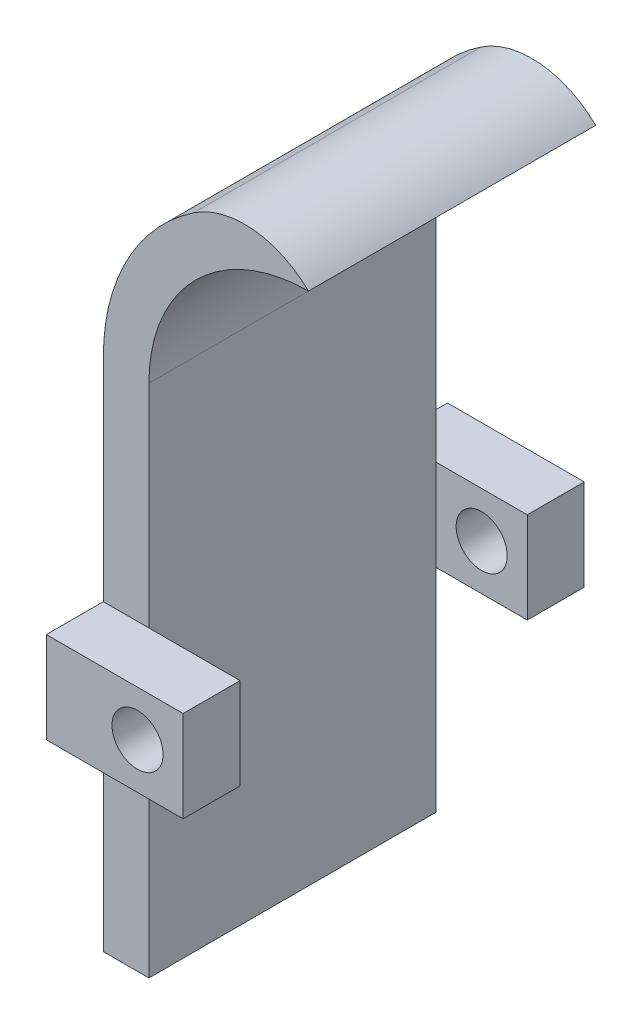
ISO-10303-21;
HEADER;
FILE_DESCRIPTION(('STEP AP214'),'2;1');
FILE_NAME('part.step','',(''),(''),'','','');
FILE_SCHEMA(('AUTOMOTIVE_DESIGN { 1 0 10303 214 1 1 1 1 }'));
ENDSEC;
DATA;
#1=APPLICATION_CONTEXT('core data for automotive mechanical design processes');
#2=APPLICATION_PROTOCOL_DEFINITION('international standard','automotive_design',2000,#1);
#3=PRODUCT_CONTEXT('',#1,'mechanical');
#4=PRODUCT('Part','Part','',(#3));
#5=PRODUCT_RELATED_PRODUCT_CATEGORY('part','',(#4));
#6=PRODUCT_DEFINITION_FORMATION('','',#4);
#7=PRODUCT_DEFINITION_CONTEXT('part definition',#1,'design');
#8=PRODUCT_DEFINITION('design','',#6,#7);
#9=PRODUCT_DEFINITION_SHAPE('','',#8);
#10=(LENGTH_UNIT() NAMED_UNIT(*) SI_UNIT(.MILLI.,.METRE.));
#11=(NAMED_UNIT(*) PLANE_ANGLE_UNIT() SI_UNIT($,.RADIAN.));
#12=(NAMED_UNIT(*) SI_UNIT($,.STERADIAN.) SOLID_ANGLE_UNIT());
#13=UNCERTAINTY_MEASURE_WITH_UNIT(LENGTH_MEASURE(1.E-05),#10,'distance_accuracy_value','');
#14=(GEOMETRIC_REPRESENTATION_CONTEXT(3) GLOBAL_UNCERTAINTY_ASSIGNED_CONTEXT((#13)) GLOBAL_UNIT_ASSIGNED_CONTEXT((#10,
#11,#12)) REPRESENTATION_CONTEXT('',''));
#15=CARTESIAN_POINT('',(0.,0.,0.));
#16=DIRECTION('',(0.,0.,1.));
#17=DIRECTION('',(1.,0.,0.));
#18=AXIS2_PLACEMENT_3D('',#15,#16,#17);
#19=CARTESIAN_POINT('',(-2.07454957260777E-13,28.702,0.));
#20=DIRECTION('',(0.,0.,-1.));
#21=DIRECTION('',(0.,-1.,0.));
#22=AXIS2_PLACEMENT_3D('',#19,#20,#21);
#23=PLANE('',#22);
#24=DIRECTION('',(-1.,0.,0.));
#25=VECTOR('',#24,1.);
#26=CARTESIAN_POINT('',(0.,16.891,0.));
#27=LINE('',#26,#25);
#28=CARTESIAN_POINT('',(-1.22086324405678E-13,16.891,0.));
#29=VERTEX_POINT('',#28);
#30=CARTESIAN_POINT('',(-2.54000000000012,16.891,0.));
#31=VERTEX_POINT('',#30);
#32=EDGE_CURVE('E104',#29,#31,#27,.T.);
#33=ORIENTED_EDGE('',*,*,#32,.T.);
#34=DIRECTION('',(0.,-1.,0.));
#35=VECTOR('',#34,1.);
#36=CARTESIAN_POINT('',(-2.54000000000021,28.702,0.));
#37=LINE('',#36,#35);
#38=CARTESIAN_POINT('',(-2.54000000000021,28.702,0.));
#39=VERTEX_POINT('',#38);
#40=EDGE_CURVE('E291',#39,#31,#37,.T.);
#41=ORIENTED_EDGE('',*,*,#40,.F.);
#42=CARTESIAN_POINT('',(8.88999999999979,28.7020000000001,0.));
#43=DIRECTION('',(0.,0.,1.));
#44=DIRECTION('',(1.,0.,0.));
#45=AXIS2_PLACEMENT_3D('',#42,#43,#44);
#46=CIRCLE('',#45,11.43);
#47=CARTESIAN_POINT('',(2.49053308342561,38.1725714285714,0.));
#48=VERTEX_POINT('',#47);
#49=EDGE_CURVE('E248',#48,#39,#46,.T.);
#50=ORIENTED_EDGE('',*,*,#49,.F.);
#51=CARTESIAN_POINT('',(5.33474060190303,33.9634285714286,0.));
#52=DIRECTION('',(0.,0.,-1.));
#53=DIRECTION('',(-1.,0.,0.));
#54=AXIS2_PLACEMENT_3D('',#51,#52,#53);
#55=CIRCLE('',#54,5.08);
#56=CARTESIAN_POINT('',(8.88999999999973,37.5920000000001,0.));
#57=VERTEX_POINT('',#56);
#58=EDGE_CURVE('E12',#48,#57,#55,.T.);
#59=ORIENTED_EDGE('',*,*,#58,.T.);
#60=CARTESIAN_POINT('',(8.88999999999979,28.7020000000001,0.));
#61=DIRECTION('',(0.,0.,1.));
#62=DIRECTION('',(1.,0.,0.));
#63=AXIS2_PLACEMENT_3D('',#60,#61,#62);
#64=CIRCLE('',#63,8.89);
#65=CARTESIAN_POINT('',(-2.07454957260777E-13,28.702,0.));
#66=VERTEX_POINT('',#65);
#67=EDGE_CURVE('E269',#57,#66,#64,.T.);
#68=ORIENTED_EDGE('',*,*,#67,.T.);
#69=DIRECTION('',(0.,-1.,0.));
#70=VECTOR('',#69,1.);
#71=CARTESIAN_POINT('',(-2.07454957260777E-13,28.702,0.));
#72=LINE('',#71,#70);
#73=EDGE_CURVE('E274',#66,#29,#72,.T.);
#74=ORIENTED_EDGE('',*,*,#73,.T.);
#75=EDGE_LOOP('',(#33,#41,#50,#59,#68,#74));
#76=FACE_BOUND('',#75,.T.);
#77=ADVANCED_FACE('F79',(#76),#23,.T.);
#78=CARTESIAN_POINT('',(8.88999999999979,28.7020000000001,16.002));
#79=DIRECTION('',(0.,0.,-1.));
#80=DIRECTION('',(-1.,0.,0.));
#81=AXIS2_PLACEMENT_3D('',#78,#79,#80);
#82=PLANE('',#81);
#83=DIRECTION('',(0.,-1.,0.));
#84=VECTOR('',#83,1.);
#85=CARTESIAN_POINT('',(-2.07454957260777E-13,28.702,16.002));
#86=LINE('',#85,#84);
#87=CARTESIAN_POINT('',(0.,11.811,16.002));
#88=VERTEX_POINT('',#87);
#89=CARTESIAN_POINT('',(0.,0.,16.002));
#90=VERTEX_POINT('',#89);
#91=EDGE_CURVE('E268',#88,#90,#86,.T.);
#92=ORIENTED_EDGE('',*,*,#91,.F.);
#93=DIRECTION('',(1.,0.,0.));
#94=VECTOR('',#93,1.);
#95=CARTESIAN_POINT('',(0.,11.811,16.002));
#96=LINE('',#95,#94);
#97=CARTESIAN_POINT('',(-2.54000000000009,11.811,16.002));
#98=VERTEX_POINT('',#97);
#99=EDGE_CURVE('E312',#98,#88,#96,.T.);
#100=ORIENTED_EDGE('',*,*,#99,.F.);
#101=DIRECTION('',(0.,-1.,0.));
#102=VECTOR('',#101,1.);
#103=CARTESIAN_POINT('',(-2.54000000000021,28.702,16.002));
#104=LINE('',#103,#102);
#105=CARTESIAN_POINT('',(-2.54,0.,16.002));
#106=VERTEX_POINT('',#105);
#107=EDGE_CURVE('E247',#98,#106,#104,.T.);
#108=ORIENTED_EDGE('',*,*,#107,.T.);
#109=DIRECTION('',(-1.,0.,0.));
#110=VECTOR('',#109,1.);
#111=CARTESIAN_POINT('',(0.,0.,16.002));
#112=LINE('',#111,#110);
#113=EDGE_CURVE('E263',#90,#106,#112,.T.);
#114=ORIENTED_EDGE('',*,*,#113,.F.);
#115=EDGE_LOOP('',(#92,#100,#108,#114));
#116=FACE_BOUND('',#115,.T.);
#117=ADVANCED_FACE('F309',(#116),#82,.F.);
#118=CARTESIAN_POINT('',(-2.54000000000021,28.702,16.002));
#119=VERTEX_POINT('',#118);
#120=CARTESIAN_POINT('',(-2.54000000000021,16.891,16.002));
#121=VERTEX_POINT('',#120);
#122=EDGE_CURVE('E255',#119,#121,#104,.T.);
#123=ORIENTED_EDGE('',*,*,#122,.T.);
#124=DIRECTION('',(-1.,0.,0.));
#125=VECTOR('',#124,1.);
#126=CARTESIAN_POINT('',(5.08,16.891,16.002));
#127=LINE('',#126,#125);
#128=CARTESIAN_POINT('',(-1.22086324405678E-13,16.891,16.002));
#129=VERTEX_POINT('',#128);
#130=EDGE_CURVE('E352',#129,#121,#127,.T.);
#131=ORIENTED_EDGE('',*,*,#130,.F.);
#132=CARTESIAN_POINT('',(-2.07454957260777E-13,28.702,16.002));
#133=VERTEX_POINT('',#132);
#134=EDGE_CURVE('E281',#133,#129,#86,.T.);
#135=ORIENTED_EDGE('',*,*,#134,.F.);
#136=CARTESIAN_POINT('',(8.88999999999979,28.7020000000001,16.002));
#137=DIRECTION('',(0.,0.,1.));
#138=DIRECTION('',(1.,0.,0.));
#139=AXIS2_PLACEMENT_3D('',#136,#137,#138);
#140=CIRCLE('',#139,8.89);
#141=CARTESIAN_POINT('',(8.88999999999973,37.5920000000001,16.002));
#142=VERTEX_POINT('',#141);
#143=EDGE_CURVE('E278',#142,#133,#140,.T.);
#144=ORIENTED_EDGE('',*,*,#143,.F.);
#145=CARTESIAN_POINT('',(5.33474060190303,33.9634285714286,16.002));
#146=DIRECTION('',(0.,0.,-1.));
#147=DIRECTION('',(-1.,0.,0.));
#148=AXIS2_PLACEMENT_3D('',#145,#146,#147);
#149=CIRCLE('',#148,5.08);
#150=CARTESIAN_POINT('',(2.49053308342561,38.1725714285714,16.002));
#151=VERTEX_POINT('',#150);
#152=EDGE_CURVE('E259',#142,#151,#149,.F.);
#153=ORIENTED_EDGE('',*,*,#152,.T.);
#154=CARTESIAN_POINT('',(8.88999999999979,28.7020000000001,16.002));
#155=DIRECTION('',(0.,0.,1.));
#156=DIRECTION('',(1.,0.,0.));
#157=AXIS2_PLACEMENT_3D('',#154,#155,#156);
#158=CIRCLE('',#157,11.43);
#159=EDGE_CURVE('E273',#151,#119,#158,.T.);
#160=ORIENTED_EDGE('',*,*,#159,.T.);
#161=EDGE_LOOP('',(#123,#131,#135,#144,#153,#160));
#162=FACE_BOUND('',#161,.T.);
#163=ADVANCED_FACE('F406',(#162),#82,.F.);
#164=DIRECTION('',(1.,0.,0.));
#165=VECTOR('',#164,1.);
#166=CARTESIAN_POINT('',(0.,11.811,0.));
#167=LINE('',#166,#165);
#168=CARTESIAN_POINT('',(-2.54000000000009,11.811,0.));
#169=VERTEX_POINT('',#168);
#170=CARTESIAN_POINT('',(-1.03727478630388E-13,11.811,0.));
#171=VERTEX_POINT('',#170);
#172=EDGE_CURVE('E231',#169,#171,#167,.T.);
#173=ORIENTED_EDGE('',*,*,#172,.T.);
#174=CARTESIAN_POINT('',(0.,0.,0.));
#175=VERTEX_POINT('',#174);
#176=EDGE_CURVE('E284',#171,#175,#72,.T.);
#177=ORIENTED_EDGE('',*,*,#176,.T.);
#178=DIRECTION('',(-1.,0.,0.));
#179=VECTOR('',#178,1.);
#180=CARTESIAN_POINT('',(0.,0.,0.));
#181=LINE('',#180,#179);
#182=CARTESIAN_POINT('',(-2.54,0.,0.));
#183=VERTEX_POINT('',#182);
#184=EDGE_CURVE('E261',#175,#183,#181,.T.);
#185=ORIENTED_EDGE('',*,*,#184,.T.);
#186=EDGE_CURVE('E83',#169,#183,#37,.T.);
#187=ORIENTED_EDGE('',*,*,#186,.F.);
#188=EDGE_LOOP('',(#173,#177,#185,#187));
#189=FACE_BOUND('',#188,.T.);
#190=ADVANCED_FACE('F302',(#189),#23,.T.);
#191=CARTESIAN_POINT('',(0.,0.,0.));
#192=DIRECTION('',(0.,-1.,0.));
#193=DIRECTION('',(0.,0.,1.));
#194=AXIS2_PLACEMENT_3D('',#191,#192,#193);
#195=PLANE('',#194);
#196=ORIENTED_EDGE('',*,*,#184,.F.);
#197=DIRECTION('',(0.,0.,1.));
#198=VECTOR('',#197,1.);
#199=CARTESIAN_POINT('',(0.,0.,0.));
#200=LINE('',#199,#198);
#201=EDGE_CURVE('E270',#175,#90,#200,.T.);
#202=ORIENTED_EDGE('',*,*,#201,.T.);
#203=ORIENTED_EDGE('',*,*,#113,.T.);
#204=DIRECTION('',(0.,0.,1.));
#205=VECTOR('',#204,1.);
#206=CARTESIAN_POINT('',(-2.54,0.,0.));
#207=LINE('',#206,#205);
#208=EDGE_CURVE('E251',#183,#106,#207,.T.);
#209=ORIENTED_EDGE('',*,*,#208,.F.);
#210=EDGE_LOOP('',(#196,#202,#203,#209));
#211=FACE_BOUND('',#210,.T.);
#212=ADVANCED_FACE('F305',(#211),#195,.T.);
#213=CARTESIAN_POINT('',(-2.54000000000021,28.702,0.));
#214=DIRECTION('',(-1.,0.,0.));
#215=DIRECTION('',(0.,-1.,0.));
#216=AXIS2_PLACEMENT_3D('',#213,#214,#215);
#217=PLANE('',#216);
#218=ORIENTED_EDGE('',*,*,#122,.F.);
#219=DIRECTION('',(0.,0.,1.));
#220=VECTOR('',#219,1.);
#221=CARTESIAN_POINT('',(-2.54000000000021,28.702,0.));
#222=LINE('',#221,#220);
#223=EDGE_CURVE('E244',#39,#119,#222,.T.);
#224=ORIENTED_EDGE('',*,*,#223,.F.);
#225=ORIENTED_EDGE('',*,*,#40,.T.);
#226=DIRECTION('',(0.,0.,1.));
#227=VECTOR('',#226,1.);
#228=CARTESIAN_POINT('',(-2.54000000000021,16.891,-3.175));
#229=LINE('',#228,#227);
#230=CARTESIAN_POINT('',(-2.54000000000021,16.891,-3.175));
#231=VERTEX_POINT('',#230);
#232=EDGE_CURVE('E241',#231,#31,#229,.T.);
#233=ORIENTED_EDGE('',*,*,#232,.F.);
#234=DIRECTION('',(0.,1.,0.));
#235=VECTOR('',#234,1.);
#236=CARTESIAN_POINT('',(-2.54000000000021,11.811,-3.175));
#237=LINE('',#236,#235);
#238=CARTESIAN_POINT('',(-2.54000000000021,11.811,-3.175));
#239=VERTEX_POINT('',#238);
#240=EDGE_CURVE('E218',#239,#231,#237,.T.);
#241=ORIENTED_EDGE('',*,*,#240,.F.);
#242=DIRECTION('',(0.,0.,1.));
#243=VECTOR('',#242,1.);
#244=CARTESIAN_POINT('',(-2.54000000000021,11.811,-3.175));
#245=LINE('',#244,#243);
#246=EDGE_CURVE('E204',#239,#169,#245,.T.);
#247=ORIENTED_EDGE('',*,*,#246,.T.);
#248=ORIENTED_EDGE('',*,*,#186,.T.);
#249=ORIENTED_EDGE('',*,*,#208,.T.);
#250=ORIENTED_EDGE('',*,*,#107,.F.);
#251=DIRECTION('',(0.,0.,-1.));
#252=VECTOR('',#251,1.);
#253=CARTESIAN_POINT('',(-2.54000000000021,11.811,19.177));
#254=LINE('',#253,#252);
#255=CARTESIAN_POINT('',(-2.54000000000021,11.811,19.177));
#256=VERTEX_POINT('',#255);
#257=EDGE_CURVE('E314',#256,#98,#254,.T.);
#258=ORIENTED_EDGE('',*,*,#257,.F.);
#259=DIRECTION('',(0.,1.,0.));
#260=VECTOR('',#259,1.);
#261=CARTESIAN_POINT('',(-2.54000000000021,11.811,19.177));
#262=LINE('',#261,#260);
#263=CARTESIAN_POINT('',(-2.54000000000021,16.891,19.177));
#264=VERTEX_POINT('',#263);
#265=EDGE_CURVE('E317',#256,#264,#262,.T.);
#266=ORIENTED_EDGE('',*,*,#265,.T.);
#267=DIRECTION('',(0.,0.,-1.));
#268=VECTOR('',#267,1.);
#269=CARTESIAN_POINT('',(-2.54000000000021,16.891,19.177));
#270=LINE('',#269,#268);
#271=EDGE_CURVE('E320',#264,#121,#270,.T.);
#272=ORIENTED_EDGE('',*,*,#271,.T.);
#273=EDGE_LOOP('',(#218,#224,#225,#233,#241,#247,#248,#249,#250,#258,#266,#272));
#274=FACE_BOUND('',#273,.T.);
#275=ADVANCED_FACE('F298',(#274),#217,.T.);
#276=CARTESIAN_POINT('',(8.88999999999979,28.7020000000001,0.));
#277=DIRECTION('',(0.,0.,1.));
#278=DIRECTION('',(1.,0.,0.));
#279=AXIS2_PLACEMENT_3D('',#276,#277,#278);
#280=CYLINDRICAL_SURFACE('',#279,11.43);
#281=ORIENTED_EDGE('',*,*,#159,.F.);
#282=DIRECTION('',(0.,0.,1.));
#283=VECTOR('',#282,1.);
#284=CARTESIAN_POINT('',(2.49053308342561,38.1725714285714,0.));
#285=LINE('',#284,#283);
#286=EDGE_CURVE('E89',#151,#48,#285,.F.);
#287=ORIENTED_EDGE('',*,*,#286,.T.);
#288=ORIENTED_EDGE('',*,*,#49,.T.);
#289=ORIENTED_EDGE('',*,*,#223,.T.);
#290=EDGE_LOOP('',(#281,#287,#288,#289));
#291=FACE_BOUND('',#290,.T.);
#292=ADVANCED_FACE('F420',(#291),#280,.T.);
#293=CARTESIAN_POINT('',(-2.07454957260777E-13,28.702,0.));
#294=DIRECTION('',(-1.,0.,0.));
#295=DIRECTION('',(0.,-1.,0.));
#296=AXIS2_PLACEMENT_3D('',#293,#294,#295);
#297=PLANE('',#296);
#298=ORIENTED_EDGE('',*,*,#134,.T.);
#299=DIRECTION('',(0.,-1.,0.));
#300=VECTOR('',#299,1.);
#301=CARTESIAN_POINT('',(-2.07454957260777E-13,28.702,16.002));
#302=LINE('',#301,#300);
#303=EDGE_CURVE('E364',#129,#88,#302,.T.);
#304=ORIENTED_EDGE('',*,*,#303,.T.);
#305=ORIENTED_EDGE('',*,*,#91,.T.);
#306=ORIENTED_EDGE('',*,*,#201,.F.);
#307=ORIENTED_EDGE('',*,*,#176,.F.);
#308=DIRECTION('',(0.,-1.,0.));
#309=VECTOR('',#308,1.);
#310=CARTESIAN_POINT('',(-2.07454957260777E-13,28.702,0.));
#311=LINE('',#310,#309);
#312=EDGE_CURVE('E355',#29,#171,#311,.T.);
#313=ORIENTED_EDGE('',*,*,#312,.F.);
#314=ORIENTED_EDGE('',*,*,#73,.F.);
#315=DIRECTION('',(0.,0.,1.));
#316=VECTOR('',#315,1.);
#317=CARTESIAN_POINT('',(-2.07454957260777E-13,28.702,0.));
#318=LINE('',#317,#316);
#319=EDGE_CURVE('E266',#66,#133,#318,.T.);
#320=ORIENTED_EDGE('',*,*,#319,.T.);
#321=EDGE_LOOP('',(#298,#304,#305,#306,#307,#313,#314,#320));
#322=FACE_BOUND('',#321,.T.);
#323=ADVANCED_FACE('F372',(#322),#297,.F.);
#324=CARTESIAN_POINT('',(8.88999999999979,28.7020000000001,0.));
#325=DIRECTION('',(0.,0.,1.));
#326=DIRECTION('',(1.,0.,0.));
#327=AXIS2_PLACEMENT_3D('',#324,#325,#326);
#328=CYLINDRICAL_SURFACE('',#327,8.89);
#329=ORIENTED_EDGE('',*,*,#143,.T.);
#330=ORIENTED_EDGE('',*,*,#319,.F.);
#331=ORIENTED_EDGE('',*,*,#67,.F.);
#332=DIRECTION('',(0.,0.,1.));
#333=VECTOR('',#332,1.);
#334=CARTESIAN_POINT('',(8.88999999999973,37.5920000000001,0.));
#335=LINE('',#334,#333);
#336=EDGE_CURVE('E275',#57,#142,#335,.T.);
#337=ORIENTED_EDGE('',*,*,#336,.T.);
#338=EDGE_LOOP('',(#329,#330,#331,#337));
#339=FACE_BOUND('',#338,.T.);
#340=ADVANCED_FACE('F428',(#339),#328,.F.);
#341=CARTESIAN_POINT('',(5.33474060190303,33.9634285714286,0.));
#342=DIRECTION('',(0.,0.,-1.));
#343=DIRECTION('',(-1.,0.,0.));
#344=AXIS2_PLACEMENT_3D('',#341,#342,#343);
#345=CYLINDRICAL_SURFACE('',#344,5.08);
#346=ORIENTED_EDGE('',*,*,#58,.F.);
#347=ORIENTED_EDGE('',*,*,#286,.F.);
#348=ORIENTED_EDGE('',*,*,#152,.F.);
#349=ORIENTED_EDGE('',*,*,#336,.F.);
#350=EDGE_LOOP('',(#346,#347,#348,#349));
#351=FACE_BOUND('',#350,.T.);
#352=ADVANCED_FACE('F81',(#351),#345,.T.);
#353=CARTESIAN_POINT('',(2.54,14.351,-3.175));
#354=DIRECTION('',(0.,0.,1.));
#355=DIRECTION('',(1.,0.,0.));
#356=AXIS2_PLACEMENT_3D('',#353,#354,#355);
#357=CYLINDRICAL_SURFACE('',#356,1.42240000000001);
#358=CARTESIAN_POINT('',(2.54,14.351,-3.175));
#359=DIRECTION('',(0.,0.,1.));
#360=DIRECTION('',(1.,0.,0.));
#361=AXIS2_PLACEMENT_3D('',#358,#359,#360);
#362=CIRCLE('',#361,1.42240000000001);
#363=CARTESIAN_POINT('',(3.96240000000001,14.351,-3.175));
#364=VERTEX_POINT('',#363);
#365=EDGE_CURVE('E232',#364,#364,#362,.T.);
#366=ORIENTED_EDGE('',*,*,#365,.F.);
#367=EDGE_LOOP('',(#366));
#368=FACE_BOUND('',#367,.T.);
#369=CARTESIAN_POINT('',(2.54,14.351,0.));
#370=DIRECTION('',(0.,0.,1.));
#371=DIRECTION('',(1.,0.,0.));
#372=AXIS2_PLACEMENT_3D('',#369,#370,#371);
#373=CIRCLE('',#372,1.42240000000001);
#374=CARTESIAN_POINT('',(3.96240000000001,14.351,0.));
#375=VERTEX_POINT('',#374);
#376=EDGE_CURVE('E627',#375,#375,#373,.T.);
#377=ORIENTED_EDGE('',*,*,#376,.T.);
#378=EDGE_LOOP('',(#377));
#379=FACE_BOUND('',#378,.T.);
#380=ADVANCED_FACE('F435',(#368,#379),#357,.F.);
#381=CARTESIAN_POINT('',(0.,0.,0.));
#382=DIRECTION('',(0.,0.,1.));
#383=DIRECTION('',(-1.,0.,0.));
#384=AXIS2_PLACEMENT_3D('',#381,#382,#383);
#385=PLANE('',#384);
#386=ORIENTED_EDGE('',*,*,#376,.F.);
#387=EDGE_LOOP('',(#386));
#388=FACE_BOUND('',#387,.T.);
#389=CARTESIAN_POINT('',(5.08,16.891,0.));
#390=VERTEX_POINT('',#389);
#391=EDGE_CURVE('E209',#390,#29,#27,.T.);
#392=ORIENTED_EDGE('',*,*,#391,.T.);
#393=ORIENTED_EDGE('',*,*,#312,.T.);
#394=CARTESIAN_POINT('',(5.08,11.811,0.));
#395=VERTEX_POINT('',#394);
#396=EDGE_CURVE('E228',#171,#395,#167,.T.);
#397=ORIENTED_EDGE('',*,*,#396,.T.);
#398=DIRECTION('',(0.,1.,0.));
#399=VECTOR('',#398,1.);
#400=CARTESIAN_POINT('',(5.08,11.811,0.));
#401=LINE('',#400,#399);
#402=EDGE_CURVE('E216',#395,#390,#401,.T.);
#403=ORIENTED_EDGE('',*,*,#402,.T.);
#404=EDGE_LOOP('',(#392,#393,#397,#403));
#405=FACE_BOUND('',#404,.T.);
#406=ADVANCED_FACE('F370',(#388,#405),#385,.T.);
#407=CARTESIAN_POINT('',(0.,0.,-3.175));
#408=DIRECTION('',(0.,0.,1.));
#409=DIRECTION('',(-1.,0.,0.));
#410=AXIS2_PLACEMENT_3D('',#407,#408,#409);
#411=PLANE('',#410);
#412=ORIENTED_EDGE('',*,*,#365,.T.);
#413=EDGE_LOOP('',(#412));
#414=FACE_BOUND('',#413,.T.);
#415=DIRECTION('',(-1.,0.,0.));
#416=VECTOR('',#415,1.);
#417=CARTESIAN_POINT('',(0.,11.811,-3.175));
#418=LINE('',#417,#416);
#419=CARTESIAN_POINT('',(5.08,11.811,-3.175));
#420=VERTEX_POINT('',#419);
#421=EDGE_CURVE('E197',#420,#239,#418,.T.);
#422=ORIENTED_EDGE('',*,*,#421,.T.);
#423=ORIENTED_EDGE('',*,*,#240,.T.);
#424=DIRECTION('',(-1.,0.,0.));
#425=VECTOR('',#424,1.);
#426=CARTESIAN_POINT('',(5.08,16.891,-3.175));
#427=LINE('',#426,#425);
#428=CARTESIAN_POINT('',(5.08,16.891,-3.175));
#429=VERTEX_POINT('',#428);
#430=EDGE_CURVE('E222',#429,#231,#427,.T.);
#431=ORIENTED_EDGE('',*,*,#430,.F.);
#432=DIRECTION('',(0.,1.,0.));
#433=VECTOR('',#432,1.);
#434=CARTESIAN_POINT('',(5.08,11.811,-3.175));
#435=LINE('',#434,#433);
#436=EDGE_CURVE('E208',#420,#429,#435,.T.);
#437=ORIENTED_EDGE('',*,*,#436,.F.);
#438=EDGE_LOOP('',(#422,#423,#431,#437));
#439=FACE_BOUND('',#438,.T.);
#440=ADVANCED_FACE('F221',(#414,#439),#411,.F.);
#441=CARTESIAN_POINT('',(0.,11.811,-3.175));
#442=DIRECTION('',(0.,-1.,0.));
#443=DIRECTION('',(1.,0.,0.));
#444=AXIS2_PLACEMENT_3D('',#441,#442,#443);
#445=PLANE('',#444);
#446=ORIENTED_EDGE('',*,*,#172,.F.);
#447=ORIENTED_EDGE('',*,*,#246,.F.);
#448=ORIENTED_EDGE('',*,*,#421,.F.);
#449=DIRECTION('',(0.,0.,1.));
#450=VECTOR('',#449,1.);
#451=CARTESIAN_POINT('',(5.08,11.811,-3.175));
#452=LINE('',#451,#450);
#453=EDGE_CURVE('E201',#420,#395,#452,.T.);
#454=ORIENTED_EDGE('',*,*,#453,.T.);
#455=ORIENTED_EDGE('',*,*,#396,.F.);
#456=EDGE_LOOP('',(#446,#447,#448,#454,#455));
#457=FACE_BOUND('',#456,.T.);
#458=ADVANCED_FACE('F199',(#457),#445,.T.);
#459=CARTESIAN_POINT('',(5.08,11.811,-3.175));
#460=DIRECTION('',(1.,0.,0.));
#461=DIRECTION('',(0.,1.,0.));
#462=AXIS2_PLACEMENT_3D('',#459,#460,#461);
#463=PLANE('',#462);
#464=ORIENTED_EDGE('',*,*,#402,.F.);
#465=ORIENTED_EDGE('',*,*,#453,.F.);
#466=ORIENTED_EDGE('',*,*,#436,.T.);
#467=DIRECTION('',(0.,0.,1.));
#468=VECTOR('',#467,1.);
#469=CARTESIAN_POINT('',(5.08,16.891,-3.175));
#470=LINE('',#469,#468);
#471=EDGE_CURVE('E217',#429,#390,#470,.T.);
#472=ORIENTED_EDGE('',*,*,#471,.T.);
#473=EDGE_LOOP('',(#464,#465,#466,#472));
#474=FACE_BOUND('',#473,.T.);
#475=ADVANCED_FACE('F213',(#474),#463,.T.);
#476=CARTESIAN_POINT('',(0.,16.891,-3.175));
#477=DIRECTION('',(0.,1.,0.));
#478=DIRECTION('',(-1.,0.,0.));
#479=AXIS2_PLACEMENT_3D('',#476,#477,#478);
#480=PLANE('',#479);
#481=ORIENTED_EDGE('',*,*,#391,.F.);
#482=ORIENTED_EDGE('',*,*,#471,.F.);
#483=ORIENTED_EDGE('',*,*,#430,.T.);
#484=ORIENTED_EDGE('',*,*,#232,.T.);
#485=ORIENTED_EDGE('',*,*,#32,.F.);
#486=EDGE_LOOP('',(#481,#482,#483,#484,#485));
#487=FACE_BOUND('',#486,.T.);
#488=ADVANCED_FACE('F375',(#487),#480,.T.);
#489=CARTESIAN_POINT('',(0.,0.,16.002));
#490=DIRECTION('',(0.,0.,-1.));
#491=DIRECTION('',(-1.,0.,0.));
#492=AXIS2_PLACEMENT_3D('',#489,#490,#491);
#493=PLANE('',#492);
#494=CARTESIAN_POINT('',(2.54,14.351,16.002));
#495=DIRECTION('',(0.,0.,1.));
#496=DIRECTION('',(1.,0.,0.));
#497=AXIS2_PLACEMENT_3D('',#494,#495,#496);
#498=CIRCLE('',#497,1.42240000000001);
#499=CARTESIAN_POINT('',(3.96240000000001,14.351,16.002));
#500=VERTEX_POINT('',#499);
#501=EDGE_CURVE('E240',#500,#500,#498,.T.);
#502=ORIENTED_EDGE('',*,*,#501,.T.);
#503=EDGE_LOOP('',(#502));
#504=FACE_BOUND('',#503,.T.);
#505=ORIENTED_EDGE('',*,*,#303,.F.);
#506=CARTESIAN_POINT('',(5.08,16.891,16.002));
#507=VERTEX_POINT('',#506);
#508=EDGE_CURVE('E344',#507,#129,#127,.T.);
#509=ORIENTED_EDGE('',*,*,#508,.F.);
#510=DIRECTION('',(0.,1.,0.));
#511=VECTOR('',#510,1.);
#512=CARTESIAN_POINT('',(5.08,11.811,16.002));
#513=LINE('',#512,#511);
#514=CARTESIAN_POINT('',(5.08,11.811,16.002));
#515=VERTEX_POINT('',#514);
#516=EDGE_CURVE('E348',#515,#507,#513,.T.);
#517=ORIENTED_EDGE('',*,*,#516,.F.);
#518=EDGE_CURVE('E337',#88,#515,#96,.T.);
#519=ORIENTED_EDGE('',*,*,#518,.F.);
#520=EDGE_LOOP('',(#505,#509,#517,#519));
#521=FACE_BOUND('',#520,.T.);
#522=ADVANCED_FACE('F386',(#504,#521),#493,.T.);
#523=CARTESIAN_POINT('',(0.,0.,19.177));
#524=DIRECTION('',(0.,0.,-1.));
#525=DIRECTION('',(-1.,0.,0.));
#526=AXIS2_PLACEMENT_3D('',#523,#524,#525);
#527=PLANE('',#526);
#528=DIRECTION('',(-1.,0.,0.));
#529=VECTOR('',#528,1.);
#530=CARTESIAN_POINT('',(0.,11.811,19.177));
#531=LINE('',#530,#529);
#532=CARTESIAN_POINT('',(5.08,11.811,19.177));
#533=VERTEX_POINT('',#532);
#534=EDGE_CURVE('E327',#533,#256,#531,.T.);
#535=ORIENTED_EDGE('',*,*,#534,.F.);
#536=DIRECTION('',(0.,1.,0.));
#537=VECTOR('',#536,1.);
#538=CARTESIAN_POINT('',(5.08,11.811,19.177));
#539=LINE('',#538,#537);
#540=CARTESIAN_POINT('',(5.08,16.891,19.177));
#541=VERTEX_POINT('',#540);
#542=EDGE_CURVE('E321',#533,#541,#539,.T.);
#543=ORIENTED_EDGE('',*,*,#542,.T.);
#544=DIRECTION('',(-1.,0.,0.));
#545=VECTOR('',#544,1.);
#546=CARTESIAN_POINT('',(0.,16.891,19.177));
#547=LINE('',#546,#545);
#548=EDGE_CURVE('E329',#541,#264,#547,.T.);
#549=ORIENTED_EDGE('',*,*,#548,.T.);
#550=ORIENTED_EDGE('',*,*,#265,.F.);
#551=EDGE_LOOP('',(#535,#543,#549,#550));
#552=FACE_BOUND('',#551,.T.);
#553=CARTESIAN_POINT('',(2.54,14.351,19.177));
#554=DIRECTION('',(0.,0.,1.));
#555=DIRECTION('',(1.,0.,0.));
#556=AXIS2_PLACEMENT_3D('',#553,#554,#555);
#557=CIRCLE('',#556,1.42240000000001);
#558=CARTESIAN_POINT('',(3.96240000000001,14.351,19.177));
#559=VERTEX_POINT('',#558);
#560=EDGE_CURVE('E349',#559,#559,#557,.T.);
#561=ORIENTED_EDGE('',*,*,#560,.F.);
#562=EDGE_LOOP('',(#561));
#563=FACE_BOUND('',#562,.T.);
#564=ADVANCED_FACE('F324',(#552,#563),#527,.F.);
#565=CARTESIAN_POINT('',(0.,11.811,19.177));
#566=DIRECTION('',(0.,1.,0.));
#567=DIRECTION('',(-1.,0.,0.));
#568=AXIS2_PLACEMENT_3D('',#565,#566,#567);
#569=PLANE('',#568);
#570=ORIENTED_EDGE('',*,*,#99,.T.);
#571=ORIENTED_EDGE('',*,*,#518,.T.);
#572=DIRECTION('',(0.,0.,-1.));
#573=VECTOR('',#572,1.);
#574=CARTESIAN_POINT('',(5.08,11.811,19.177));
#575=LINE('',#574,#573);
#576=EDGE_CURVE('E334',#533,#515,#575,.T.);
#577=ORIENTED_EDGE('',*,*,#576,.F.);
#578=ORIENTED_EDGE('',*,*,#534,.T.);
#579=ORIENTED_EDGE('',*,*,#257,.T.);
#580=EDGE_LOOP('',(#570,#571,#577,#578,#579));
#581=FACE_BOUND('',#580,.T.);
#582=ADVANCED_FACE('F332',(#581),#569,.F.);
#583=CARTESIAN_POINT('',(5.08,11.811,19.177));
#584=DIRECTION('',(-1.,0.,0.));
#585=DIRECTION('',(0.,-1.,0.));
#586=AXIS2_PLACEMENT_3D('',#583,#584,#585);
#587=PLANE('',#586);
#588=ORIENTED_EDGE('',*,*,#516,.T.);
#589=DIRECTION('',(0.,0.,-1.));
#590=VECTOR('',#589,1.);
#591=CARTESIAN_POINT('',(5.08,16.891,19.177));
#592=LINE('',#591,#590);
#593=EDGE_CURVE('E358',#541,#507,#592,.T.);
#594=ORIENTED_EDGE('',*,*,#593,.F.);
#595=ORIENTED_EDGE('',*,*,#542,.F.);
#596=ORIENTED_EDGE('',*,*,#576,.T.);
#597=EDGE_LOOP('',(#588,#594,#595,#596));
#598=FACE_BOUND('',#597,.T.);
#599=ADVANCED_FACE('F396',(#598),#587,.F.);
#600=CARTESIAN_POINT('',(5.08,16.891,19.177));
#601=DIRECTION('',(0.,-1.,0.));
#602=DIRECTION('',(0.,0.,-1.));
#603=AXIS2_PLACEMENT_3D('',#600,#601,#602);
#604=PLANE('',#603);
#605=ORIENTED_EDGE('',*,*,#508,.T.);
#606=ORIENTED_EDGE('',*,*,#130,.T.);
#607=ORIENTED_EDGE('',*,*,#271,.F.);
#608=ORIENTED_EDGE('',*,*,#548,.F.);
#609=ORIENTED_EDGE('',*,*,#593,.T.);
#610=EDGE_LOOP('',(#605,#606,#607,#608,#609));
#611=FACE_BOUND('',#610,.T.);
#612=ADVANCED_FACE('F391',(#611),#604,.F.);
#613=CARTESIAN_POINT('',(2.54,14.351,19.177));
#614=DIRECTION('',(0.,0.,-1.));
#615=DIRECTION('',(-1.,0.,0.));
#616=AXIS2_PLACEMENT_3D('',#613,#614,#615);
#617=CYLINDRICAL_SURFACE('',#616,1.42240000000001);
#618=ORIENTED_EDGE('',*,*,#560,.T.);
#619=EDGE_LOOP('',(#618));
#620=FACE_BOUND('',#619,.T.);
#621=ORIENTED_EDGE('',*,*,#501,.F.);
#622=EDGE_LOOP('',(#621));
#623=FACE_BOUND('',#622,.T.);
#624=ADVANCED_FACE('F389',(#620,#623),#617,.F.);
#625=CLOSED_SHELL('',(#77,#117,#163,#190,#212,#275,#292,#323,#340,#352,#380,#406,#440,#458,#475,
#488,#522,#564,#582,#599,#612,#624));
#626=MANIFOLD_SOLID_BREP('B2',#625);
#627=ADVANCED_BREP_SHAPE_REPRESENTATION('',(#18,#626),#14);
#628=SHAPE_DEFINITION_REPRESENTATION(#9,#627);
ENDSEC;
END-ISO-10303-21;
